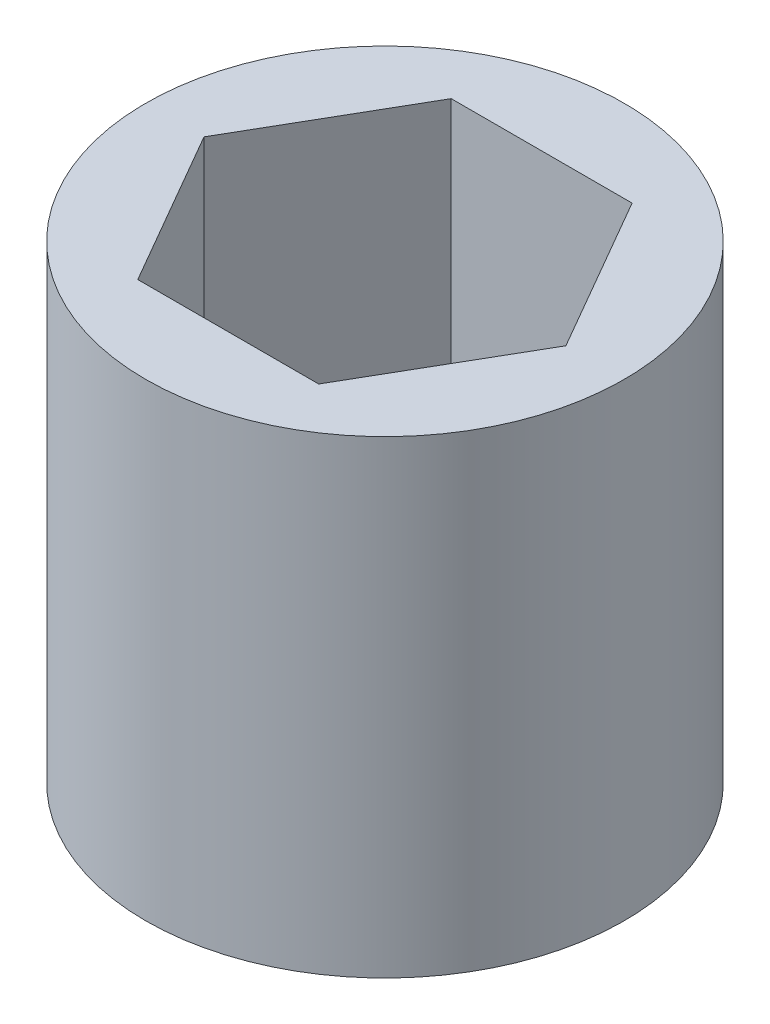
ISO-10303-21;
HEADER;
FILE_DESCRIPTION(('STEP AP214'),'2;1');
FILE_NAME('part.step','',(''),(''),'','','');
FILE_SCHEMA(('AUTOMOTIVE_DESIGN { 1 0 10303 214 1 1 1 1 }'));
ENDSEC;
DATA;
#1=APPLICATION_CONTEXT('core data for automotive mechanical design processes');
#2=APPLICATION_PROTOCOL_DEFINITION('international standard','automotive_design',2000,#1);
#3=PRODUCT_CONTEXT('',#1,'mechanical');
#4=PRODUCT('Part','Part','',(#3));
#5=PRODUCT_RELATED_PRODUCT_CATEGORY('part','',(#4));
#6=PRODUCT_DEFINITION_FORMATION('','',#4);
#7=PRODUCT_DEFINITION_CONTEXT('part definition',#1,'design');
#8=PRODUCT_DEFINITION('design','',#6,#7);
#9=PRODUCT_DEFINITION_SHAPE('','',#8);
#10=(LENGTH_UNIT() NAMED_UNIT(*) SI_UNIT(.MILLI.,.METRE.));
#11=(NAMED_UNIT(*) PLANE_ANGLE_UNIT() SI_UNIT($,.RADIAN.));
#12=(NAMED_UNIT(*) SI_UNIT($,.STERADIAN.) SOLID_ANGLE_UNIT());
#13=UNCERTAINTY_MEASURE_WITH_UNIT(LENGTH_MEASURE(1.E-05),#10,'distance_accuracy_value','');
#14=(GEOMETRIC_REPRESENTATION_CONTEXT(3) GLOBAL_UNCERTAINTY_ASSIGNED_CONTEXT((#13)) GLOBAL_UNIT_ASSIGNED_CONTEXT((#10,
#11,#12)) REPRESENTATION_CONTEXT('',''));
#15=CARTESIAN_POINT('',(0.,0.,0.));
#16=DIRECTION('',(0.,0.,1.));
#17=DIRECTION('',(1.,0.,0.));
#18=AXIS2_PLACEMENT_3D('',#15,#16,#17);
#19=CARTESIAN_POINT('',(0.,7.35,0.));
#20=DIRECTION('',(0.,1.,0.));
#21=DIRECTION('',(0.,0.,1.));
#22=AXIS2_PLACEMENT_3D('',#19,#20,#21);
#23=PLANE('',#22);
#24=CARTESIAN_POINT('',(0.,7.35,0.));
#25=DIRECTION('',(0.,1.,0.));
#26=DIRECTION('',(0.,0.,1.));
#27=AXIS2_PLACEMENT_3D('',#24,#25,#26);
#28=CIRCLE('',#27,7.5);
#29=CARTESIAN_POINT('',(0.,7.35,7.5));
#30=VERTEX_POINT('',#29);
#31=EDGE_CURVE('E11',#30,#30,#28,.T.);
#32=ORIENTED_EDGE('',*,*,#31,.T.);
#33=EDGE_LOOP('',(#32));
#34=FACE_BOUND('',#33,.T.);
#35=DIRECTION('',(1.,0.,0.));
#36=VECTOR('',#35,1.);
#37=CARTESIAN_POINT('',(-2.83623319739402,7.35,4.9125));
#38=LINE('',#37,#36);
#39=CARTESIAN_POINT('',(-2.83623319739402,7.35,4.9125));
#40=VERTEX_POINT('',#39);
#41=CARTESIAN_POINT('',(2.83623319739404,7.35,4.9125));
#42=VERTEX_POINT('',#41);
#43=EDGE_CURVE('E100',#40,#42,#38,.T.);
#44=ORIENTED_EDGE('',*,*,#43,.F.);
#45=DIRECTION('',(0.499999999999998,0.,0.86602540378444));
#46=VECTOR('',#45,1.);
#47=CARTESIAN_POINT('',(-5.67246639478804,7.35,0.));
#48=LINE('',#47,#46);
#49=CARTESIAN_POINT('',(-5.67246639478804,7.35,0.));
#50=VERTEX_POINT('',#49);
#51=EDGE_CURVE('E92',#50,#40,#48,.T.);
#52=ORIENTED_EDGE('',*,*,#51,.F.);
#53=DIRECTION('',(-0.499999999999998,0.,0.86602540378444));
#54=VECTOR('',#53,1.);
#55=CARTESIAN_POINT('',(-2.83623319739402,7.35,-4.9125));
#56=LINE('',#55,#54);
#57=CARTESIAN_POINT('',(-2.83623319739402,7.35,-4.9125));
#58=VERTEX_POINT('',#57);
#59=EDGE_CURVE('E120',#58,#50,#56,.T.);
#60=ORIENTED_EDGE('',*,*,#59,.F.);
#61=DIRECTION('',(-1.,0.,0.));
#62=VECTOR('',#61,1.);
#63=CARTESIAN_POINT('',(2.83623319739402,7.35,-4.9125));
#64=LINE('',#63,#62);
#65=CARTESIAN_POINT('',(2.83623319739402,7.35,-4.9125));
#66=VERTEX_POINT('',#65);
#67=EDGE_CURVE('E118',#66,#58,#64,.T.);
#68=ORIENTED_EDGE('',*,*,#67,.F.);
#69=DIRECTION('',(-0.499999999999998,0.,-0.86602540378444));
#70=VECTOR('',#69,1.);
#71=CARTESIAN_POINT('',(5.67246639478804,7.35,0.));
#72=LINE('',#71,#70);
#73=CARTESIAN_POINT('',(5.67246639478804,7.35,0.));
#74=VERTEX_POINT('',#73);
#75=EDGE_CURVE('E114',#74,#66,#72,.T.);
#76=ORIENTED_EDGE('',*,*,#75,.F.);
#77=DIRECTION('',(0.499999999999996,0.,-0.866025403784441));
#78=VECTOR('',#77,1.);
#79=CARTESIAN_POINT('',(2.83623319739404,7.35,4.9125));
#80=LINE('',#79,#78);
#81=EDGE_CURVE('E112',#42,#74,#80,.T.);
#82=ORIENTED_EDGE('',*,*,#81,.F.);
#83=EDGE_LOOP('',(#44,#52,#60,#68,#76,#82));
#84=FACE_BOUND('',#83,.T.);
#85=ADVANCED_FACE('F39',(#34,#84),#23,.T.);
#86=CARTESIAN_POINT('',(0.,-7.35,0.));
#87=DIRECTION('',(0.,1.,0.));
#88=DIRECTION('',(0.,0.,1.));
#89=AXIS2_PLACEMENT_3D('',#86,#87,#88);
#90=PLANE('',#89);
#91=CARTESIAN_POINT('',(0.,-7.35,0.));
#92=DIRECTION('',(0.,1.,0.));
#93=DIRECTION('',(0.,0.,1.));
#94=AXIS2_PLACEMENT_3D('',#91,#92,#93);
#95=CIRCLE('',#94,7.5);
#96=CARTESIAN_POINT('',(0.,-7.35,7.5));
#97=VERTEX_POINT('',#96);
#98=EDGE_CURVE('E43',#97,#97,#95,.T.);
#99=ORIENTED_EDGE('',*,*,#98,.F.);
#100=EDGE_LOOP('',(#99));
#101=FACE_BOUND('',#100,.T.);
#102=DIRECTION('',(0.499999999999998,0.,0.86602540378444));
#103=VECTOR('',#102,1.);
#104=CARTESIAN_POINT('',(-5.67246639478804,-7.35,0.));
#105=LINE('',#104,#103);
#106=CARTESIAN_POINT('',(-5.67246639478804,-7.35,0.));
#107=VERTEX_POINT('',#106);
#108=CARTESIAN_POINT('',(-2.83623319739402,-7.35,4.9125));
#109=VERTEX_POINT('',#108);
#110=EDGE_CURVE('E62',#107,#109,#105,.T.);
#111=ORIENTED_EDGE('',*,*,#110,.T.);
#112=DIRECTION('',(1.,0.,0.));
#113=VECTOR('',#112,1.);
#114=CARTESIAN_POINT('',(-2.83623319739402,-7.35,4.9125));
#115=LINE('',#114,#113);
#116=CARTESIAN_POINT('',(2.83623319739404,-7.35,4.9125));
#117=VERTEX_POINT('',#116);
#118=EDGE_CURVE('E107',#109,#117,#115,.T.);
#119=ORIENTED_EDGE('',*,*,#118,.T.);
#120=DIRECTION('',(0.499999999999996,0.,-0.866025403784441));
#121=VECTOR('',#120,1.);
#122=CARTESIAN_POINT('',(2.83623319739404,-7.35,4.9125));
#123=LINE('',#122,#121);
#124=CARTESIAN_POINT('',(5.67246639478804,-7.35,0.));
#125=VERTEX_POINT('',#124);
#126=EDGE_CURVE('E124',#117,#125,#123,.T.);
#127=ORIENTED_EDGE('',*,*,#126,.T.);
#128=DIRECTION('',(-0.499999999999998,0.,-0.86602540378444));
#129=VECTOR('',#128,1.);
#130=CARTESIAN_POINT('',(5.67246639478804,-7.35,0.));
#131=LINE('',#130,#129);
#132=CARTESIAN_POINT('',(2.83623319739402,-7.35,-4.9125));
#133=VERTEX_POINT('',#132);
#134=EDGE_CURVE('E127',#125,#133,#131,.T.);
#135=ORIENTED_EDGE('',*,*,#134,.T.);
#136=DIRECTION('',(-1.,0.,0.));
#137=VECTOR('',#136,1.);
#138=CARTESIAN_POINT('',(2.83623319739402,-7.35,-4.9125));
#139=LINE('',#138,#137);
#140=CARTESIAN_POINT('',(-2.83623319739402,-7.35,-4.9125));
#141=VERTEX_POINT('',#140);
#142=EDGE_CURVE('E130',#133,#141,#139,.T.);
#143=ORIENTED_EDGE('',*,*,#142,.T.);
#144=DIRECTION('',(-0.499999999999998,0.,0.86602540378444));
#145=VECTOR('',#144,1.);
#146=CARTESIAN_POINT('',(-2.83623319739402,-7.35,-4.9125));
#147=LINE('',#146,#145);
#148=EDGE_CURVE('E101',#141,#107,#147,.T.);
#149=ORIENTED_EDGE('',*,*,#148,.T.);
#150=EDGE_LOOP('',(#111,#119,#127,#135,#143,#149));
#151=FACE_BOUND('',#150,.T.);
#152=ADVANCED_FACE('F147',(#101,#151),#90,.F.);
#153=CARTESIAN_POINT('',(0.,7.35,0.));
#154=DIRECTION('',(0.,-1.,0.));
#155=DIRECTION('',(0.,0.,-1.));
#156=AXIS2_PLACEMENT_3D('',#153,#154,#155);
#157=CYLINDRICAL_SURFACE('',#156,7.5);
#158=ORIENTED_EDGE('',*,*,#31,.F.);
#159=EDGE_LOOP('',(#158));
#160=FACE_BOUND('',#159,.T.);
#161=ORIENTED_EDGE('',*,*,#98,.T.);
#162=EDGE_LOOP('',(#161));
#163=FACE_BOUND('',#162,.T.);
#164=ADVANCED_FACE('F41',(#160,#163),#157,.T.);
#165=CARTESIAN_POINT('',(-5.67246639478804,7.35,0.));
#166=DIRECTION('',(0.86602540378444,0.,-0.499999999999998));
#167=DIRECTION('',(-0.499999999999998,0.,-0.86602540378444));
#168=AXIS2_PLACEMENT_3D('',#165,#166,#167);
#169=PLANE('',#168);
#170=ORIENTED_EDGE('',*,*,#110,.F.);
#171=DIRECTION('',(0.,-1.,0.));
#172=VECTOR('',#171,1.);
#173=CARTESIAN_POINT('',(-5.67246639478804,7.35,0.));
#174=LINE('',#173,#172);
#175=EDGE_CURVE('E96',#50,#107,#174,.T.);
#176=ORIENTED_EDGE('',*,*,#175,.F.);
#177=ORIENTED_EDGE('',*,*,#51,.T.);
#178=DIRECTION('',(0.,-1.,0.));
#179=VECTOR('',#178,1.);
#180=CARTESIAN_POINT('',(-2.83623319739402,7.35,4.9125));
#181=LINE('',#180,#179);
#182=EDGE_CURVE('E95',#40,#109,#181,.T.);
#183=ORIENTED_EDGE('',*,*,#182,.T.);
#184=EDGE_LOOP('',(#170,#176,#177,#183));
#185=FACE_BOUND('',#184,.T.);
#186=ADVANCED_FACE('F94',(#185),#169,.T.);
#187=CARTESIAN_POINT('',(-2.83623319739402,7.35,4.9125));
#188=DIRECTION('',(0.,0.,-1.));
#189=DIRECTION('',(-1.,0.,0.));
#190=AXIS2_PLACEMENT_3D('',#187,#188,#189);
#191=PLANE('',#190);
#192=ORIENTED_EDGE('',*,*,#118,.F.);
#193=ORIENTED_EDGE('',*,*,#182,.F.);
#194=ORIENTED_EDGE('',*,*,#43,.T.);
#195=DIRECTION('',(0.,-1.,0.));
#196=VECTOR('',#195,1.);
#197=CARTESIAN_POINT('',(2.83623319739404,7.35,4.9125));
#198=LINE('',#197,#196);
#199=EDGE_CURVE('E108',#42,#117,#198,.T.);
#200=ORIENTED_EDGE('',*,*,#199,.T.);
#201=EDGE_LOOP('',(#192,#193,#194,#200));
#202=FACE_BOUND('',#201,.T.);
#203=ADVANCED_FACE('F104',(#202),#191,.T.);
#204=CARTESIAN_POINT('',(2.83623319739404,7.35,4.9125));
#205=DIRECTION('',(-0.866025403784441,0.,-0.499999999999996));
#206=DIRECTION('',(-0.499999999999996,0.,0.866025403784441));
#207=AXIS2_PLACEMENT_3D('',#204,#205,#206);
#208=PLANE('',#207);
#209=ORIENTED_EDGE('',*,*,#126,.F.);
#210=ORIENTED_EDGE('',*,*,#199,.F.);
#211=ORIENTED_EDGE('',*,*,#81,.T.);
#212=DIRECTION('',(0.,-1.,0.));
#213=VECTOR('',#212,1.);
#214=CARTESIAN_POINT('',(5.67246639478804,7.35,0.));
#215=LINE('',#214,#213);
#216=EDGE_CURVE('E139',#74,#125,#215,.T.);
#217=ORIENTED_EDGE('',*,*,#216,.T.);
#218=EDGE_LOOP('',(#209,#210,#211,#217));
#219=FACE_BOUND('',#218,.T.);
#220=ADVANCED_FACE('F143',(#219),#208,.T.);
#221=CARTESIAN_POINT('',(5.67246639478804,7.35,0.));
#222=DIRECTION('',(-0.86602540378444,0.,0.499999999999998));
#223=DIRECTION('',(0.499999999999998,0.,0.86602540378444));
#224=AXIS2_PLACEMENT_3D('',#221,#222,#223);
#225=PLANE('',#224);
#226=ORIENTED_EDGE('',*,*,#134,.F.);
#227=ORIENTED_EDGE('',*,*,#216,.F.);
#228=ORIENTED_EDGE('',*,*,#75,.T.);
#229=DIRECTION('',(0.,-1.,0.));
#230=VECTOR('',#229,1.);
#231=CARTESIAN_POINT('',(2.83623319739402,7.35,-4.9125));
#232=LINE('',#231,#230);
#233=EDGE_CURVE('E137',#66,#133,#232,.T.);
#234=ORIENTED_EDGE('',*,*,#233,.T.);
#235=EDGE_LOOP('',(#226,#227,#228,#234));
#236=FACE_BOUND('',#235,.T.);
#237=ADVANCED_FACE('F155',(#236),#225,.T.);
#238=CARTESIAN_POINT('',(2.83623319739402,7.35,-4.9125));
#239=DIRECTION('',(0.,0.,1.));
#240=DIRECTION('',(1.,0.,0.));
#241=AXIS2_PLACEMENT_3D('',#238,#239,#240);
#242=PLANE('',#241);
#243=ORIENTED_EDGE('',*,*,#142,.F.);
#244=ORIENTED_EDGE('',*,*,#233,.F.);
#245=ORIENTED_EDGE('',*,*,#67,.T.);
#246=DIRECTION('',(0.,-1.,0.));
#247=VECTOR('',#246,1.);
#248=CARTESIAN_POINT('',(-2.83623319739402,7.35,-4.9125));
#249=LINE('',#248,#247);
#250=EDGE_CURVE('E54',#58,#141,#249,.T.);
#251=ORIENTED_EDGE('',*,*,#250,.T.);
#252=EDGE_LOOP('',(#243,#244,#245,#251));
#253=FACE_BOUND('',#252,.T.);
#254=ADVANCED_FACE('F153',(#253),#242,.T.);
#255=CARTESIAN_POINT('',(-2.83623319739402,7.35,-4.9125));
#256=DIRECTION('',(0.86602540378444,0.,0.499999999999998));
#257=DIRECTION('',(0.499999999999998,0.,-0.86602540378444));
#258=AXIS2_PLACEMENT_3D('',#255,#256,#257);
#259=PLANE('',#258);
#260=ORIENTED_EDGE('',*,*,#148,.F.);
#261=ORIENTED_EDGE('',*,*,#250,.F.);
#262=ORIENTED_EDGE('',*,*,#59,.T.);
#263=ORIENTED_EDGE('',*,*,#175,.T.);
#264=EDGE_LOOP('',(#260,#261,#262,#263));
#265=FACE_BOUND('',#264,.T.);
#266=ADVANCED_FACE('F149',(#265),#259,.T.);
#267=CLOSED_SHELL('',(#85,#152,#164,#186,#203,#220,#237,#254,#266));
#268=MANIFOLD_SOLID_BREP('B2',#267);
#269=ADVANCED_BREP_SHAPE_REPRESENTATION('',(#18,#268),#14);
#270=SHAPE_DEFINITION_REPRESENTATION(#9,#269);
ENDSEC;
END-ISO-10303-21;
